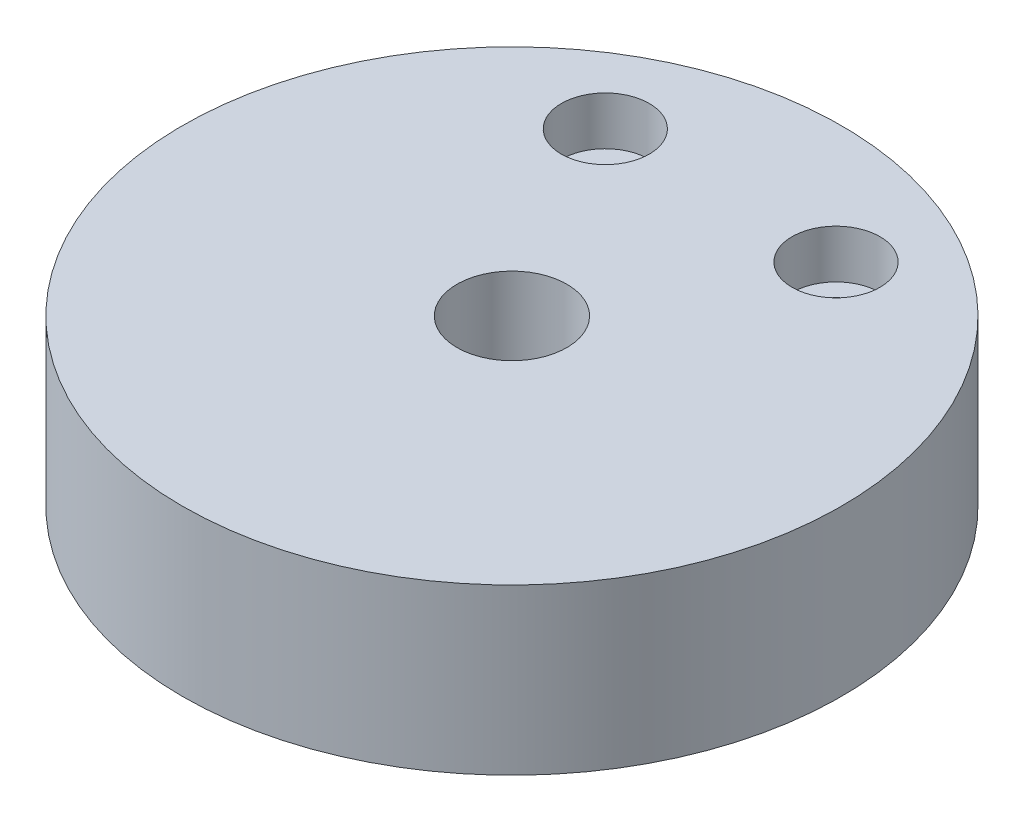
ISO-10303-21;
HEADER;
FILE_DESCRIPTION(('STEP AP214'),'2;1');
FILE_NAME('part.step','',(''),(''),'','','');
FILE_SCHEMA(('AUTOMOTIVE_DESIGN { 1 0 10303 214 1 1 1 1 }'));
ENDSEC;
DATA;
#1=APPLICATION_CONTEXT('core data for automotive mechanical design processes');
#2=APPLICATION_PROTOCOL_DEFINITION('international standard','automotive_design',2000,#1);
#3=PRODUCT_CONTEXT('',#1,'mechanical');
#4=PRODUCT('Part','Part','',(#3));
#5=PRODUCT_RELATED_PRODUCT_CATEGORY('part','',(#4));
#6=PRODUCT_DEFINITION_FORMATION('','',#4);
#7=PRODUCT_DEFINITION_CONTEXT('part definition',#1,'design');
#8=PRODUCT_DEFINITION('design','',#6,#7);
#9=PRODUCT_DEFINITION_SHAPE('','',#8);
#10=(LENGTH_UNIT() NAMED_UNIT(*) SI_UNIT(.MILLI.,.METRE.));
#11=(NAMED_UNIT(*) PLANE_ANGLE_UNIT() SI_UNIT($,.RADIAN.));
#12=(NAMED_UNIT(*) SI_UNIT($,.STERADIAN.) SOLID_ANGLE_UNIT());
#13=UNCERTAINTY_MEASURE_WITH_UNIT(LENGTH_MEASURE(1.E-05),#10,'distance_accuracy_value','');
#14=(GEOMETRIC_REPRESENTATION_CONTEXT(3) GLOBAL_UNCERTAINTY_ASSIGNED_CONTEXT((#13)) GLOBAL_UNIT_ASSIGNED_CONTEXT((#10,
#11,#12)) REPRESENTATION_CONTEXT('',''));
#15=CARTESIAN_POINT('',(0.,0.,0.));
#16=DIRECTION('',(0.,0.,1.));
#17=DIRECTION('',(1.,0.,0.));
#18=AXIS2_PLACEMENT_3D('',#15,#16,#17);
#19=CARTESIAN_POINT('',(121.722144348823,15.,-83.9358310413758));
#20=DIRECTION('',(0.,-1.,0.));
#21=DIRECTION('',(0.,0.,-1.));
#22=AXIS2_PLACEMENT_3D('',#19,#20,#21);
#23=CYLINDRICAL_SURFACE('',#22,30.);
#24=CARTESIAN_POINT('',(121.722144348823,15.,-83.9358310413758));
#25=DIRECTION('',(0.,1.,0.));
#26=DIRECTION('',(0.,0.,1.));
#27=AXIS2_PLACEMENT_3D('',#24,#25,#26);
#28=CIRCLE('',#27,30.);
#29=CARTESIAN_POINT('',(121.722144348823,15.,-53.9358310413758));
#30=VERTEX_POINT('',#29);
#31=EDGE_CURVE('E12',#30,#30,#28,.T.);
#32=ORIENTED_EDGE('',*,*,#31,.F.);
#33=EDGE_LOOP('',(#32));
#34=FACE_BOUND('',#33,.T.);
#35=CARTESIAN_POINT('',(121.722144348823,0.,-83.9358310413758));
#36=DIRECTION('',(0.,1.,0.));
#37=DIRECTION('',(0.,0.,1.));
#38=AXIS2_PLACEMENT_3D('',#35,#36,#37);
#39=CIRCLE('',#38,30.);
#40=CARTESIAN_POINT('',(121.722144348823,0.,-53.9358310413758));
#41=VERTEX_POINT('',#40);
#42=EDGE_CURVE('E48',#41,#41,#39,.T.);
#43=ORIENTED_EDGE('',*,*,#42,.T.);
#44=EDGE_LOOP('',(#43));
#45=FACE_BOUND('',#44,.T.);
#46=ADVANCED_FACE('F45',(#34,#45),#23,.T.);
#47=CARTESIAN_POINT('',(121.722144348823,15.,-83.9358310413758));
#48=DIRECTION('',(0.,1.,0.));
#49=DIRECTION('',(0.,0.,1.));
#50=AXIS2_PLACEMENT_3D('',#47,#48,#49);
#51=PLANE('',#50);
#52=CARTESIAN_POINT('',(132.222144348823,15.,-102.935831041376));
#53=DIRECTION('',(0.,1.,0.));
#54=DIRECTION('',(0.,0.,1.));
#55=AXIS2_PLACEMENT_3D('',#52,#53,#54);
#56=CIRCLE('',#55,4.);
#57=CARTESIAN_POINT('',(132.222144348823,15.,-98.9358310413758));
#58=VERTEX_POINT('',#57);
#59=EDGE_CURVE('E83',#58,#58,#56,.T.);
#60=ORIENTED_EDGE('',*,*,#59,.F.);
#61=EDGE_LOOP('',(#60));
#62=FACE_BOUND('',#61,.T.);
#63=CARTESIAN_POINT('',(111.222144348823,15.,-102.935831041376));
#64=DIRECTION('',(0.,1.,0.));
#65=DIRECTION('',(0.,0.,1.));
#66=AXIS2_PLACEMENT_3D('',#63,#64,#65);
#67=CIRCLE('',#66,3.99999999999999);
#68=CARTESIAN_POINT('',(111.222144348823,15.,-98.9358310413758));
#69=VERTEX_POINT('',#68);
#70=EDGE_CURVE('E71',#69,#69,#67,.T.);
#71=ORIENTED_EDGE('',*,*,#70,.F.);
#72=EDGE_LOOP('',(#71));
#73=FACE_BOUND('',#72,.T.);
#74=CARTESIAN_POINT('',(121.722144348823,15.,-83.9358310413758));
#75=DIRECTION('',(0.,1.,0.));
#76=DIRECTION('',(0.,0.,1.));
#77=AXIS2_PLACEMENT_3D('',#74,#75,#76);
#78=CIRCLE('',#77,5.00000000000003);
#79=CARTESIAN_POINT('',(121.722144348823,15.,-78.9358310413758));
#80=VERTEX_POINT('',#79);
#81=EDGE_CURVE('E57',#80,#80,#78,.T.);
#82=ORIENTED_EDGE('',*,*,#81,.F.);
#83=EDGE_LOOP('',(#82));
#84=FACE_BOUND('',#83,.T.);
#85=ORIENTED_EDGE('',*,*,#31,.T.);
#86=EDGE_LOOP('',(#85));
#87=FACE_BOUND('',#86,.T.);
#88=ADVANCED_FACE('F89',(#62,#73,#84,#87),#51,.T.);
#89=CARTESIAN_POINT('',(121.722144348823,0.,-83.9358310413758));
#90=DIRECTION('',(0.,1.,0.));
#91=DIRECTION('',(0.,0.,1.));
#92=AXIS2_PLACEMENT_3D('',#89,#90,#91);
#93=PLANE('',#92);
#94=CARTESIAN_POINT('',(132.222144348823,0.,-102.935831041376));
#95=DIRECTION('',(0.,1.,0.));
#96=DIRECTION('',(0.,0.,1.));
#97=AXIS2_PLACEMENT_3D('',#94,#95,#96);
#98=CIRCLE('',#97,2.25);
#99=CARTESIAN_POINT('',(132.222144348823,0.,-100.685831041376));
#100=VERTEX_POINT('',#99);
#101=EDGE_CURVE('E74',#100,#100,#98,.T.);
#102=ORIENTED_EDGE('',*,*,#101,.T.);
#103=EDGE_LOOP('',(#102));
#104=FACE_BOUND('',#103,.T.);
#105=CARTESIAN_POINT('',(111.222144348823,0.,-102.935831041376));
#106=DIRECTION('',(0.,1.,0.));
#107=DIRECTION('',(0.,0.,1.));
#108=AXIS2_PLACEMENT_3D('',#105,#106,#107);
#109=CIRCLE('',#108,2.25000000000001);
#110=CARTESIAN_POINT('',(111.222144348823,0.,-100.685831041376));
#111=VERTEX_POINT('',#110);
#112=EDGE_CURVE('E60',#111,#111,#109,.T.);
#113=ORIENTED_EDGE('',*,*,#112,.T.);
#114=EDGE_LOOP('',(#113));
#115=FACE_BOUND('',#114,.T.);
#116=CARTESIAN_POINT('',(121.722144348823,0.,-83.9358310413758));
#117=DIRECTION('',(0.,1.,0.));
#118=DIRECTION('',(0.,0.,1.));
#119=AXIS2_PLACEMENT_3D('',#116,#117,#118);
#120=CIRCLE('',#119,5.00000000000003);
#121=CARTESIAN_POINT('',(121.722144348823,0.,-78.9358310413758));
#122=VERTEX_POINT('',#121);
#123=EDGE_CURVE('E55',#122,#122,#120,.T.);
#124=ORIENTED_EDGE('',*,*,#123,.T.);
#125=EDGE_LOOP('',(#124));
#126=FACE_BOUND('',#125,.T.);
#127=ORIENTED_EDGE('',*,*,#42,.F.);
#128=EDGE_LOOP('',(#127));
#129=FACE_BOUND('',#128,.T.);
#130=ADVANCED_FACE('F92',(#104,#115,#126,#129),#93,.F.);
#131=CARTESIAN_POINT('',(121.722144348823,0.,-83.9358310413758));
#132=DIRECTION('',(0.,1.,0.));
#133=DIRECTION('',(0.,0.,1.));
#134=AXIS2_PLACEMENT_3D('',#131,#132,#133);
#135=CYLINDRICAL_SURFACE('',#134,5.00000000000003);
#136=ORIENTED_EDGE('',*,*,#123,.F.);
#137=EDGE_LOOP('',(#136));
#138=FACE_BOUND('',#137,.T.);
#139=ORIENTED_EDGE('',*,*,#81,.T.);
#140=EDGE_LOOP('',(#139));
#141=FACE_BOUND('',#140,.T.);
#142=ADVANCED_FACE('F98',(#138,#141),#135,.F.);
#143=CARTESIAN_POINT('',(111.222144348823,15.,-102.935831041376));
#144=DIRECTION('',(0.,1.,0.));
#145=DIRECTION('',(0.,0.,1.));
#146=AXIS2_PLACEMENT_3D('',#143,#144,#145);
#147=CYLINDRICAL_SURFACE('',#146,2.25000000000001);
#148=ORIENTED_EDGE('',*,*,#112,.F.);
#149=EDGE_LOOP('',(#148));
#150=FACE_BOUND('',#149,.T.);
#151=CARTESIAN_POINT('',(111.222144348823,10.6,-102.935831041376));
#152=DIRECTION('',(0.,1.,0.));
#153=DIRECTION('',(0.,0.,1.));
#154=AXIS2_PLACEMENT_3D('',#151,#152,#153);
#155=CIRCLE('',#154,2.25000000000002);
#156=CARTESIAN_POINT('',(111.222144348823,10.6,-100.685831041376));
#157=VERTEX_POINT('',#156);
#158=EDGE_CURVE('E65',#157,#157,#155,.T.);
#159=ORIENTED_EDGE('',*,*,#158,.T.);
#160=EDGE_LOOP('',(#159));
#161=FACE_BOUND('',#160,.T.);
#162=ADVANCED_FACE('F100',(#150,#161),#147,.F.);
#163=CARTESIAN_POINT('',(113.472144348823,10.6,-102.935831041376));
#164=DIRECTION('',(0.,-1.,0.));
#165=DIRECTION('',(0.,0.,-1.));
#166=AXIS2_PLACEMENT_3D('',#163,#164,#165);
#167=PLANE('',#166);
#168=ORIENTED_EDGE('',*,*,#158,.F.);
#169=EDGE_LOOP('',(#168));
#170=FACE_BOUND('',#169,.T.);
#171=CARTESIAN_POINT('',(111.222144348823,10.6,-102.935831041376));
#172=DIRECTION('',(0.,1.,0.));
#173=DIRECTION('',(0.,0.,1.));
#174=AXIS2_PLACEMENT_3D('',#171,#172,#173);
#175=CIRCLE('',#174,3.99999999999999);
#176=CARTESIAN_POINT('',(111.222144348823,10.6,-98.9358310413758));
#177=VERTEX_POINT('',#176);
#178=EDGE_CURVE('E68',#177,#177,#175,.T.);
#179=ORIENTED_EDGE('',*,*,#178,.T.);
#180=EDGE_LOOP('',(#179));
#181=FACE_BOUND('',#180,.T.);
#182=ADVANCED_FACE('F107',(#170,#181),#167,.F.);
#183=CARTESIAN_POINT('',(111.222144348823,15.,-102.935831041376));
#184=DIRECTION('',(0.,1.,0.));
#185=DIRECTION('',(0.,0.,1.));
#186=AXIS2_PLACEMENT_3D('',#183,#184,#185);
#187=CYLINDRICAL_SURFACE('',#186,3.99999999999999);
#188=ORIENTED_EDGE('',*,*,#178,.F.);
#189=EDGE_LOOP('',(#188));
#190=FACE_BOUND('',#189,.T.);
#191=ORIENTED_EDGE('',*,*,#70,.T.);
#192=EDGE_LOOP('',(#191));
#193=FACE_BOUND('',#192,.T.);
#194=ADVANCED_FACE('F143',(#190,#193),#187,.F.);
#195=CARTESIAN_POINT('',(132.222144348823,15.,-102.935831041376));
#196=DIRECTION('',(0.,1.,0.));
#197=DIRECTION('',(0.,0.,1.));
#198=AXIS2_PLACEMENT_3D('',#195,#196,#197);
#199=CYLINDRICAL_SURFACE('',#198,2.25);
#200=ORIENTED_EDGE('',*,*,#101,.F.);
#201=EDGE_LOOP('',(#200));
#202=FACE_BOUND('',#201,.T.);
#203=CARTESIAN_POINT('',(132.222144348823,10.6,-102.935831041376));
#204=DIRECTION('',(0.,1.,0.));
#205=DIRECTION('',(0.,0.,1.));
#206=AXIS2_PLACEMENT_3D('',#203,#204,#205);
#207=CIRCLE('',#206,2.25);
#208=CARTESIAN_POINT('',(132.222144348823,10.6,-100.685831041376));
#209=VERTEX_POINT('',#208);
#210=EDGE_CURVE('E77',#209,#209,#207,.T.);
#211=ORIENTED_EDGE('',*,*,#210,.T.);
#212=EDGE_LOOP('',(#211));
#213=FACE_BOUND('',#212,.T.);
#214=ADVANCED_FACE('F153',(#202,#213),#199,.F.);
#215=CARTESIAN_POINT('',(134.472144348823,10.6,-102.935831041376));
#216=DIRECTION('',(0.,-1.,0.));
#217=DIRECTION('',(0.,0.,-1.));
#218=AXIS2_PLACEMENT_3D('',#215,#216,#217);
#219=PLANE('',#218);
#220=ORIENTED_EDGE('',*,*,#210,.F.);
#221=EDGE_LOOP('',(#220));
#222=FACE_BOUND('',#221,.T.);
#223=CARTESIAN_POINT('',(132.222144348823,10.6,-102.935831041376));
#224=DIRECTION('',(0.,1.,0.));
#225=DIRECTION('',(0.,0.,1.));
#226=AXIS2_PLACEMENT_3D('',#223,#224,#225);
#227=CIRCLE('',#226,4.);
#228=CARTESIAN_POINT('',(132.222144348823,10.6,-98.9358310413758));
#229=VERTEX_POINT('',#228);
#230=EDGE_CURVE('E80',#229,#229,#227,.T.);
#231=ORIENTED_EDGE('',*,*,#230,.T.);
#232=EDGE_LOOP('',(#231));
#233=FACE_BOUND('',#232,.T.);
#234=ADVANCED_FACE('F163',(#222,#233),#219,.F.);
#235=CARTESIAN_POINT('',(132.222144348823,15.,-102.935831041376));
#236=DIRECTION('',(0.,1.,0.));
#237=DIRECTION('',(0.,0.,1.));
#238=AXIS2_PLACEMENT_3D('',#235,#236,#237);
#239=CYLINDRICAL_SURFACE('',#238,4.);
#240=ORIENTED_EDGE('',*,*,#230,.F.);
#241=EDGE_LOOP('',(#240));
#242=FACE_BOUND('',#241,.T.);
#243=ORIENTED_EDGE('',*,*,#59,.T.);
#244=EDGE_LOOP('',(#243));
#245=FACE_BOUND('',#244,.T.);
#246=ADVANCED_FACE('F87',(#242,#245),#239,.F.);
#247=CLOSED_SHELL('',(#46,#88,#130,#142,#162,#182,#194,#214,#234,#246));
#248=MANIFOLD_SOLID_BREP('B2',#247);
#249=ADVANCED_BREP_SHAPE_REPRESENTATION('',(#18,#248),#14);
#250=SHAPE_DEFINITION_REPRESENTATION(#9,#249);
ENDSEC;
END-ISO-10303-21;
